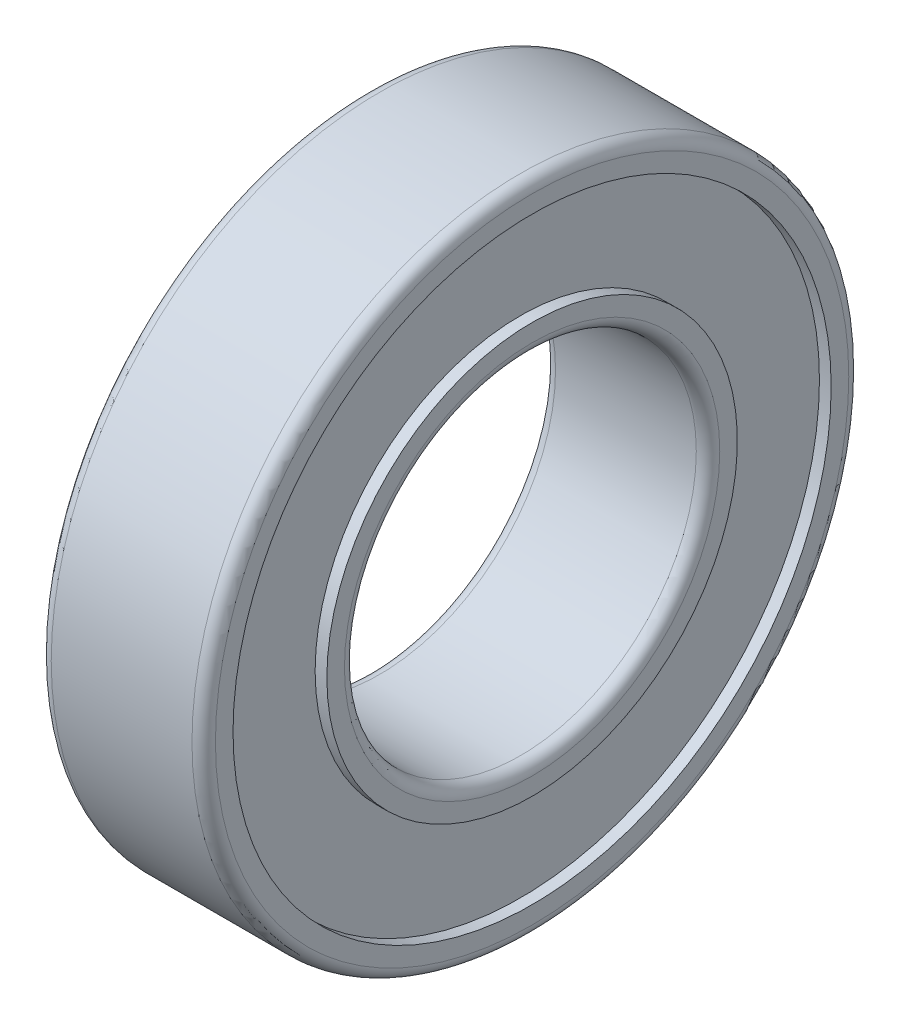
ISO-10303-21;
HEADER;
FILE_DESCRIPTION(('STEP AP214'),'2;1');
FILE_NAME('part.step','',(''),(''),'','','');
FILE_SCHEMA(('AUTOMOTIVE_DESIGN { 1 0 10303 214 1 1 1 1 }'));
ENDSEC;
DATA;
#1=APPLICATION_CONTEXT('core data for automotive mechanical design processes');
#2=APPLICATION_PROTOCOL_DEFINITION('international standard','automotive_design',2000,#1);
#3=PRODUCT_CONTEXT('',#1,'mechanical');
#4=PRODUCT('Part','Part','',(#3));
#5=PRODUCT_RELATED_PRODUCT_CATEGORY('part','',(#4));
#6=PRODUCT_DEFINITION_FORMATION('','',#4);
#7=PRODUCT_DEFINITION_CONTEXT('part definition',#1,'design');
#8=PRODUCT_DEFINITION('design','',#6,#7);
#9=PRODUCT_DEFINITION_SHAPE('','',#8);
#10=(LENGTH_UNIT() NAMED_UNIT(*) SI_UNIT(.MILLI.,.METRE.));
#11=(NAMED_UNIT(*) PLANE_ANGLE_UNIT() SI_UNIT($,.RADIAN.));
#12=(NAMED_UNIT(*) SI_UNIT($,.STERADIAN.) SOLID_ANGLE_UNIT());
#13=UNCERTAINTY_MEASURE_WITH_UNIT(LENGTH_MEASURE(1.E-05),#10,'distance_accuracy_value','');
#14=(GEOMETRIC_REPRESENTATION_CONTEXT(3) GLOBAL_UNCERTAINTY_ASSIGNED_CONTEXT((#13)) GLOBAL_UNIT_ASSIGNED_CONTEXT((#10,
#11,#12)) REPRESENTATION_CONTEXT('',''));
#15=CARTESIAN_POINT('',(0.,0.,0.));
#16=DIRECTION('',(0.,0.,1.));
#17=DIRECTION('',(1.,0.,0.));
#18=AXIS2_PLACEMENT_3D('',#15,#16,#17);
#19=CARTESIAN_POINT('',(0.500000000000167,12.7500000000076,0.));
#20=DIRECTION('',(0.999999999999998,0.,0.));
#21=DIRECTION('',(0.,0.,-1.));
#22=AXIS2_PLACEMENT_3D('',#19,#20,#21);
#23=PLANE('',#22);
#24=CARTESIAN_POINT('',(0.500000000000167,0.,0.));
#25=DIRECTION('',(-0.999999999999998,0.,0.));
#26=DIRECTION('',(0.,0.,1.));
#27=AXIS2_PLACEMENT_3D('',#24,#25,#26);
#28=CIRCLE('',#27,12.75);
#29=CARTESIAN_POINT('',(0.500000000000155,0.,12.75));
#30=VERTEX_POINT('',#29);
#31=EDGE_CURVE('E297',#30,#30,#28,.T.);
#32=ORIENTED_EDGE('',*,*,#31,.T.);
#33=EDGE_LOOP('',(#32));
#34=FACE_BOUND('',#33,.T.);
#35=CARTESIAN_POINT('',(0.500000000000167,0.,0.));
#36=DIRECTION('',(-0.999999999999998,0.,0.));
#37=DIRECTION('',(0.,0.,1.));
#38=AXIS2_PLACEMENT_3D('',#35,#36,#37);
#39=CIRCLE('',#38,8.75);
#40=CARTESIAN_POINT('',(0.500000000000159,0.,8.75000000000001));
#41=VERTEX_POINT('',#40);
#42=EDGE_CURVE('E295',#41,#41,#39,.T.);
#43=ORIENTED_EDGE('',*,*,#42,.F.);
#44=EDGE_LOOP('',(#43));
#45=FACE_BOUND('',#44,.T.);
#46=ADVANCED_FACE('F16',(#34,#45),#23,.F.);
#47=CARTESIAN_POINT('',(0.,0.,0.));
#48=DIRECTION('',(-0.999999999999998,0.,0.));
#49=DIRECTION('',(0.,0.,1.));
#50=AXIS2_PLACEMENT_3D('',#47,#48,#49);
#51=CYLINDRICAL_SURFACE('',#50,12.75);
#52=ORIENTED_EDGE('',*,*,#31,.F.);
#53=EDGE_LOOP('',(#52));
#54=FACE_BOUND('',#53,.T.);
#55=CARTESIAN_POINT('',(0.,0.,0.));
#56=DIRECTION('',(-0.999999999999998,0.,0.));
#57=DIRECTION('',(0.,0.,1.));
#58=AXIS2_PLACEMENT_3D('',#55,#56,#57);
#59=CIRCLE('',#58,12.75);
#60=CARTESIAN_POINT('',(0.,0.,12.75));
#61=VERTEX_POINT('',#60);
#62=EDGE_CURVE('E292',#61,#61,#59,.T.);
#63=ORIENTED_EDGE('',*,*,#62,.T.);
#64=EDGE_LOOP('',(#63));
#65=FACE_BOUND('',#64,.T.);
#66=ADVANCED_FACE('F101',(#54,#65),#51,.F.);
#67=CARTESIAN_POINT('',(0.,0.,0.));
#68=DIRECTION('',(-0.999999999999998,0.,0.));
#69=DIRECTION('',(0.,0.,1.));
#70=AXIS2_PLACEMENT_3D('',#67,#68,#69);
#71=CYLINDRICAL_SURFACE('',#70,8.75);
#72=CARTESIAN_POINT('',(0.,0.,0.));
#73=DIRECTION('',(-0.999999999999998,0.,0.));
#74=DIRECTION('',(0.,0.,1.));
#75=AXIS2_PLACEMENT_3D('',#72,#73,#74);
#76=CIRCLE('',#75,8.75);
#77=CARTESIAN_POINT('',(0.,0.,8.75000000000001));
#78=VERTEX_POINT('',#77);
#79=EDGE_CURVE('E69',#78,#78,#76,.F.);
#80=ORIENTED_EDGE('',*,*,#79,.T.);
#81=EDGE_LOOP('',(#80));
#82=FACE_BOUND('',#81,.T.);
#83=ORIENTED_EDGE('',*,*,#42,.T.);
#84=EDGE_LOOP('',(#83));
#85=FACE_BOUND('',#84,.T.);
#86=ADVANCED_FACE('F89',(#82,#85),#71,.T.);
#87=CARTESIAN_POINT('',(0.,13.9999999999993,0.));
#88=DIRECTION('',(0.999999999999998,0.,0.));
#89=DIRECTION('',(0.,0.,-1.));
#90=AXIS2_PLACEMENT_3D('',#87,#88,#89);
#91=PLANE('',#90);
#92=ORIENTED_EDGE('',*,*,#62,.F.);
#93=EDGE_LOOP('',(#92));
#94=FACE_BOUND('',#93,.T.);
#95=CARTESIAN_POINT('',(-3.37262769795066E-12,0.,0.));
#96=DIRECTION('',(0.999999999999998,0.,0.));
#97=DIRECTION('',(0.,1.05278415696682E-12,-1.));
#98=AXIS2_PLACEMENT_3D('',#95,#96,#97);
#99=CIRCLE('',#98,13.5000000000001);
#100=CARTESIAN_POINT('',(-3.5527136788005E-12,1.4210854715202E-11,-13.5000000000001));
#101=VERTEX_POINT('',#100);
#102=CARTESIAN_POINT('',(0.,7.105427357601E-12,13.5000000000005));
#103=VERTEX_POINT('',#102);
#104=EDGE_CURVE('E56',#101,#103,#99,.T.);
#105=ORIENTED_EDGE('',*,*,#104,.F.);
#106=CARTESIAN_POINT('',(-3.36915825099871E-12,0.,0.));
#107=DIRECTION('',(0.999999999999998,0.,0.));
#108=DIRECTION('',(0.,-1.0526616922869E-12,1.));
#109=AXIS2_PLACEMENT_3D('',#106,#107,#108);
#110=CIRCLE('',#109,13.5000000000001);
#111=EDGE_CURVE('E58',#103,#101,#110,.T.);
#112=ORIENTED_EDGE('',*,*,#111,.F.);
#113=EDGE_LOOP('',(#105,#112));
#114=FACE_BOUND('',#113,.T.);
#115=ADVANCED_FACE('F68',(#94,#114),#91,.F.);
#116=CARTESIAN_POINT('',(0.,8.75000000000625,4.44089209850063E-13));
#117=DIRECTION('',(0.999999999999998,0.,0.));
#118=DIRECTION('',(0.,0.,-1.));
#119=AXIS2_PLACEMENT_3D('',#116,#117,#118);
#120=PLANE('',#119);
#121=ORIENTED_EDGE('',*,*,#79,.F.);
#122=EDGE_LOOP('',(#121));
#123=FACE_BOUND('',#122,.T.);
#124=CARTESIAN_POINT('',(1.74664969987415E-13,0.,0.));
#125=DIRECTION('',(-0.999999999999998,0.,0.));
#126=DIRECTION('',(0.,0.,-1.));
#127=AXIS2_PLACEMENT_3D('',#124,#125,#126);
#128=CIRCLE('',#127,7.99999999999645);
#129=CARTESIAN_POINT('',(0.,0.,-7.99999999999645));
#130=VERTEX_POINT('',#129);
#131=CARTESIAN_POINT('',(0.,7.105427357601E-12,7.99999999999823));
#132=VERTEX_POINT('',#131);
#133=EDGE_CURVE('E64',#130,#132,#128,.T.);
#134=ORIENTED_EDGE('',*,*,#133,.F.);
#135=CARTESIAN_POINT('',(1.78134416939368E-13,0.,0.));
#136=DIRECTION('',(-0.999999999999998,0.,0.));
#137=DIRECTION('',(0.,0.,1.));
#138=AXIS2_PLACEMENT_3D('',#135,#136,#137);
#139=CIRCLE('',#138,7.99999999999645);
#140=EDGE_CURVE('E239',#132,#130,#139,.T.);
#141=ORIENTED_EDGE('',*,*,#140,.F.);
#142=EDGE_LOOP('',(#134,#141));
#143=FACE_BOUND('',#142,.T.);
#144=ADVANCED_FACE('F88',(#123,#143),#120,.F.);
#145=CARTESIAN_POINT('',(0.499999999996627,0.,0.));
#146=DIRECTION('',(0.999999999999998,0.,0.));
#147=DIRECTION('',(0.,1.05265590482977E-12,-1.));
#148=AXIS2_PLACEMENT_3D('',#145,#146,#147);
#149=TOROIDAL_SURFACE('',#148,13.5000000000001,0.5);
#150=ORIENTED_EDGE('',*,*,#104,.T.);
#151=ORIENTED_EDGE('',*,*,#111,.T.);
#152=EDGE_LOOP('',(#150,#151));
#153=FACE_BOUND('',#152,.T.);
#154=CARTESIAN_POINT('',(0.500000000000167,0.,0.));
#155=DIRECTION('',(-0.999999999999998,0.,0.));
#156=DIRECTION('',(0.,0.,1.));
#157=AXIS2_PLACEMENT_3D('',#154,#155,#156);
#158=CIRCLE('',#157,14.);
#159=CARTESIAN_POINT('',(0.500000000000153,0.,14.));
#160=VERTEX_POINT('',#159);
#161=EDGE_CURVE('E236',#160,#160,#158,.F.);
#162=ORIENTED_EDGE('',*,*,#161,.F.);
#163=EDGE_LOOP('',(#162));
#164=FACE_BOUND('',#163,.T.);
#165=ADVANCED_FACE('F60',(#153,#164),#149,.T.);
#166=CARTESIAN_POINT('',(0.500000000000175,0.,0.));
#167=DIRECTION('',(0.999999999999998,0.,0.));
#168=DIRECTION('',(0.,0.,-1.));
#169=AXIS2_PLACEMENT_3D('',#166,#167,#168);
#170=TOROIDAL_SURFACE('',#169,7.99999999999645,0.5);
#171=ORIENTED_EDGE('',*,*,#133,.T.);
#172=ORIENTED_EDGE('',*,*,#140,.T.);
#173=EDGE_LOOP('',(#171,#172));
#174=FACE_BOUND('',#173,.T.);
#175=CARTESIAN_POINT('',(0.500000000000167,0.,0.));
#176=DIRECTION('',(-0.999999999999998,0.,0.));
#177=DIRECTION('',(0.,0.,1.));
#178=AXIS2_PLACEMENT_3D('',#175,#176,#177);
#179=CIRCLE('',#178,7.5);
#180=CARTESIAN_POINT('',(0.50000000000016,0.,7.50000000000001));
#181=VERTEX_POINT('',#180);
#182=EDGE_CURVE('E232',#181,#181,#179,.F.);
#183=ORIENTED_EDGE('',*,*,#182,.T.);
#184=EDGE_LOOP('',(#183));
#185=FACE_BOUND('',#184,.T.);
#186=ADVANCED_FACE('F216',(#174,#185),#170,.T.);
#187=CARTESIAN_POINT('',(0.,0.,0.));
#188=DIRECTION('',(-0.999999999999998,0.,0.));
#189=DIRECTION('',(0.,0.,1.));
#190=AXIS2_PLACEMENT_3D('',#187,#188,#189);
#191=CYLINDRICAL_SURFACE('',#190,14.);
#192=CARTESIAN_POINT('',(6.49999999999995,0.,0.));
#193=DIRECTION('',(-0.999999999999998,0.,0.));
#194=DIRECTION('',(0.,0.,1.));
#195=AXIS2_PLACEMENT_3D('',#192,#193,#194);
#196=CIRCLE('',#195,14.);
#197=CARTESIAN_POINT('',(6.49999999999994,0.,14.));
#198=VERTEX_POINT('',#197);
#199=EDGE_CURVE('E262',#198,#198,#196,.F.);
#200=ORIENTED_EDGE('',*,*,#199,.F.);
#201=EDGE_LOOP('',(#200));
#202=FACE_BOUND('',#201,.T.);
#203=ORIENTED_EDGE('',*,*,#161,.T.);
#204=EDGE_LOOP('',(#203));
#205=FACE_BOUND('',#204,.T.);
#206=ADVANCED_FACE('F226',(#202,#205),#191,.T.);
#207=CARTESIAN_POINT('',(0.,0.,0.));
#208=DIRECTION('',(-0.999999999999998,0.,0.));
#209=DIRECTION('',(0.,0.,1.));
#210=AXIS2_PLACEMENT_3D('',#207,#208,#209);
#211=CYLINDRICAL_SURFACE('',#210,7.5);
#212=CARTESIAN_POINT('',(6.49999999999995,0.,0.));
#213=DIRECTION('',(-0.999999999999998,0.,0.));
#214=DIRECTION('',(0.,0.,1.));
#215=AXIS2_PLACEMENT_3D('',#212,#213,#214);
#216=CIRCLE('',#215,7.5);
#217=CARTESIAN_POINT('',(6.49999999999994,0.,7.50000000000001));
#218=VERTEX_POINT('',#217);
#219=EDGE_CURVE('E264',#218,#218,#216,.T.);
#220=ORIENTED_EDGE('',*,*,#219,.F.);
#221=EDGE_LOOP('',(#220));
#222=FACE_BOUND('',#221,.T.);
#223=ORIENTED_EDGE('',*,*,#182,.F.);
#224=EDGE_LOOP('',(#223));
#225=FACE_BOUND('',#224,.T.);
#226=ADVANCED_FACE('F323',(#222,#225),#211,.F.);
#227=CARTESIAN_POINT('',(6.49999999999994,0.,0.));
#228=DIRECTION('',(-0.999999999999998,0.,0.));
#229=DIRECTION('',(0.,5.26327952414869E-13,1.));
#230=AXIS2_PLACEMENT_3D('',#227,#228,#229);
#231=TOROIDAL_SURFACE('',#230,13.5000000000005,0.5);
#232=CARTESIAN_POINT('',(6.99999999999994,0.,0.));
#233=DIRECTION('',(-0.999999999999998,0.,0.));
#234=DIRECTION('',(0.,5.26199700277826E-13,1.));
#235=AXIS2_PLACEMENT_3D('',#232,#233,#234);
#236=CIRCLE('',#235,13.5000000000005);
#237=CARTESIAN_POINT('',(7.00000000000012,7.105427357601E-12,13.5000000000005));
#238=VERTEX_POINT('',#237);
#239=CARTESIAN_POINT('',(6.99999999999656,1.4210854715202E-11,-13.5000000000001));
#240=VERTEX_POINT('',#239);
#241=EDGE_CURVE('E154',#238,#240,#236,.T.);
#242=ORIENTED_EDGE('',*,*,#241,.T.);
#243=CARTESIAN_POINT('',(6.99999999999993,0.,0.));
#244=DIRECTION('',(-0.999999999999998,0.,0.));
#245=DIRECTION('',(0.,-5.26077235597911E-13,-1.));
#246=AXIS2_PLACEMENT_3D('',#243,#244,#245);
#247=CIRCLE('',#246,13.5000000000005);
#248=EDGE_CURVE('E165',#240,#238,#247,.T.);
#249=ORIENTED_EDGE('',*,*,#248,.T.);
#250=EDGE_LOOP('',(#242,#249));
#251=FACE_BOUND('',#250,.T.);
#252=ORIENTED_EDGE('',*,*,#199,.T.);
#253=EDGE_LOOP('',(#252));
#254=FACE_BOUND('',#253,.T.);
#255=ADVANCED_FACE('F181',(#251,#254),#231,.T.);
#256=CARTESIAN_POINT('',(6.49999999999994,0.,0.));
#257=DIRECTION('',(-0.999999999999998,0.,0.));
#258=DIRECTION('',(0.,8.88178419700223E-13,1.));
#259=AXIS2_PLACEMENT_3D('',#256,#257,#258);
#260=TOROIDAL_SURFACE('',#259,7.99999999999912,0.5);
#261=CARTESIAN_POINT('',(6.99999999999994,0.,0.));
#262=DIRECTION('',(0.999999999999998,0.,0.));
#263=DIRECTION('',(0.,8.87717064859134E-13,1.));
#264=AXIS2_PLACEMENT_3D('',#261,#262,#263);
#265=CIRCLE('',#264,7.99999999999912);
#266=CARTESIAN_POINT('',(7.00000000000012,7.105427357601E-12,7.99999999999912));
#267=VERTEX_POINT('',#266);
#268=CARTESIAN_POINT('',(7.00000000000012,0.,-7.99999999999645));
#269=VERTEX_POINT('',#268);
#270=EDGE_CURVE('E279',#267,#269,#265,.T.);
#271=ORIENTED_EDGE('',*,*,#270,.T.);
#272=CARTESIAN_POINT('',(6.99999999999994,0.,0.));
#273=DIRECTION('',(0.999999999999998,0.,0.));
#274=DIRECTION('',(0.,-8.87839529539048E-13,-1.));
#275=AXIS2_PLACEMENT_3D('',#272,#273,#274);
#276=CIRCLE('',#275,7.99999999999912);
#277=EDGE_CURVE('E35',#269,#267,#276,.T.);
#278=ORIENTED_EDGE('',*,*,#277,.T.);
#279=EDGE_LOOP('',(#271,#278));
#280=FACE_BOUND('',#279,.T.);
#281=ORIENTED_EDGE('',*,*,#219,.T.);
#282=EDGE_LOOP('',(#281));
#283=FACE_BOUND('',#282,.T.);
#284=ADVANCED_FACE('F177',(#280,#283),#260,.T.);
#285=CARTESIAN_POINT('',(7.00000000000012,12.7500000000076,4.44089209850063E-13));
#286=DIRECTION('',(-0.999999999999998,0.,0.));
#287=DIRECTION('',(0.,0.,1.));
#288=AXIS2_PLACEMENT_3D('',#285,#286,#287);
#289=PLANE('',#288);
#290=CARTESIAN_POINT('',(7.00000000000012,0.,0.));
#291=DIRECTION('',(-0.999999999999998,0.,0.));
#292=DIRECTION('',(0.,0.,1.));
#293=AXIS2_PLACEMENT_3D('',#290,#291,#292);
#294=CIRCLE('',#293,12.75);
#295=CARTESIAN_POINT('',(7.0000000000001,0.,12.75));
#296=VERTEX_POINT('',#295);
#297=EDGE_CURVE('E280',#296,#296,#294,.T.);
#298=ORIENTED_EDGE('',*,*,#297,.T.);
#299=EDGE_LOOP('',(#298));
#300=FACE_BOUND('',#299,.T.);
#301=ORIENTED_EDGE('',*,*,#241,.F.);
#302=ORIENTED_EDGE('',*,*,#248,.F.);
#303=EDGE_LOOP('',(#301,#302));
#304=FACE_BOUND('',#303,.T.);
#305=ADVANCED_FACE('F133',(#300,#304),#289,.F.);
#306=CARTESIAN_POINT('',(7.00000000000012,7.50000000000028,0.));
#307=DIRECTION('',(-0.999999999999998,0.,0.));
#308=DIRECTION('',(0.,0.,1.));
#309=AXIS2_PLACEMENT_3D('',#306,#307,#308);
#310=PLANE('',#309);
#311=CARTESIAN_POINT('',(7.00000000000012,0.,0.));
#312=DIRECTION('',(-0.999999999999998,0.,0.));
#313=DIRECTION('',(0.,0.,1.));
#314=AXIS2_PLACEMENT_3D('',#311,#312,#313);
#315=CIRCLE('',#314,8.75);
#316=CARTESIAN_POINT('',(7.00000000000011,0.,8.75000000000001));
#317=VERTEX_POINT('',#316);
#318=EDGE_CURVE('E282',#317,#317,#315,.T.);
#319=ORIENTED_EDGE('',*,*,#318,.F.);
#320=EDGE_LOOP('',(#319));
#321=FACE_BOUND('',#320,.T.);
#322=ORIENTED_EDGE('',*,*,#270,.F.);
#323=ORIENTED_EDGE('',*,*,#277,.F.);
#324=EDGE_LOOP('',(#322,#323));
#325=FACE_BOUND('',#324,.T.);
#326=ADVANCED_FACE('F128',(#321,#325),#310,.F.);
#327=CARTESIAN_POINT('',(0.,0.,0.));
#328=DIRECTION('',(-0.999999999999998,0.,0.));
#329=DIRECTION('',(0.,0.,1.));
#330=AXIS2_PLACEMENT_3D('',#327,#328,#329);
#331=CYLINDRICAL_SURFACE('',#330,12.75);
#332=ORIENTED_EDGE('',*,*,#297,.F.);
#333=EDGE_LOOP('',(#332));
#334=FACE_BOUND('',#333,.T.);
#335=CARTESIAN_POINT('',(6.49999999999995,0.,0.));
#336=DIRECTION('',(-0.999999999999998,0.,0.));
#337=DIRECTION('',(0.,0.,1.));
#338=AXIS2_PLACEMENT_3D('',#335,#336,#337);
#339=CIRCLE('',#338,12.75);
#340=CARTESIAN_POINT('',(6.49999999999994,0.,12.75));
#341=VERTEX_POINT('',#340);
#342=EDGE_CURVE('E27',#341,#341,#339,.T.);
#343=ORIENTED_EDGE('',*,*,#342,.T.);
#344=EDGE_LOOP('',(#343));
#345=FACE_BOUND('',#344,.T.);
#346=ADVANCED_FACE('F120',(#334,#345),#331,.F.);
#347=CARTESIAN_POINT('',(0.,0.,0.));
#348=DIRECTION('',(-0.999999999999998,0.,0.));
#349=DIRECTION('',(0.,0.,1.));
#350=AXIS2_PLACEMENT_3D('',#347,#348,#349);
#351=CYLINDRICAL_SURFACE('',#350,8.75);
#352=CARTESIAN_POINT('',(6.49999999999995,0.,0.));
#353=DIRECTION('',(-0.999999999999998,0.,0.));
#354=DIRECTION('',(0.,0.,1.));
#355=AXIS2_PLACEMENT_3D('',#352,#353,#354);
#356=CIRCLE('',#355,8.75);
#357=CARTESIAN_POINT('',(6.49999999999994,0.,8.75000000000001));
#358=VERTEX_POINT('',#357);
#359=EDGE_CURVE('E11',#358,#358,#356,.F.);
#360=ORIENTED_EDGE('',*,*,#359,.T.);
#361=EDGE_LOOP('',(#360));
#362=FACE_BOUND('',#361,.T.);
#363=ORIENTED_EDGE('',*,*,#318,.T.);
#364=EDGE_LOOP('',(#363));
#365=FACE_BOUND('',#364,.T.);
#366=ADVANCED_FACE('F114',(#362,#365),#351,.T.);
#367=CARTESIAN_POINT('',(6.49999999999995,8.75000000000625,4.44089209850063E-13));
#368=DIRECTION('',(-0.999999999999998,0.,0.));
#369=DIRECTION('',(0.,0.,1.));
#370=AXIS2_PLACEMENT_3D('',#367,#368,#369);
#371=PLANE('',#370);
#372=ORIENTED_EDGE('',*,*,#359,.F.);
#373=EDGE_LOOP('',(#372));
#374=FACE_BOUND('',#373,.T.);
#375=ORIENTED_EDGE('',*,*,#342,.F.);
#376=EDGE_LOOP('',(#375));
#377=FACE_BOUND('',#376,.T.);
#378=ADVANCED_FACE('F112',(#374,#377),#371,.F.);
#379=CLOSED_SHELL('',(#46,#66,#86,#115,#144,#165,#186,#206,#226,#255,#284,#305,#326,#346,#366,#378));
#380=MANIFOLD_SOLID_BREP('B1',#379);
#381=ADVANCED_BREP_SHAPE_REPRESENTATION('',(#18,#380),#14);
#382=SHAPE_DEFINITION_REPRESENTATION(#9,#381);
ENDSEC;
END-ISO-10303-21;
